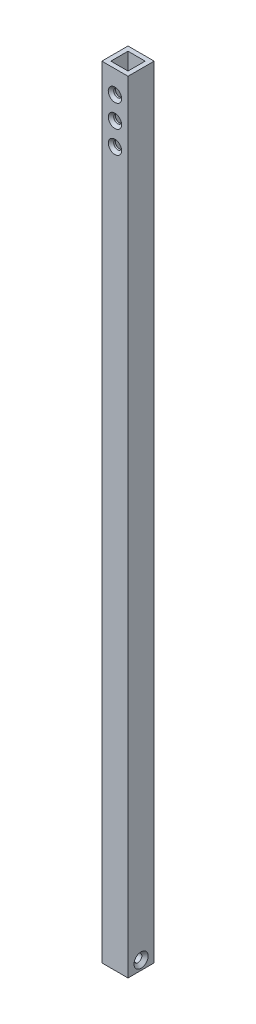
ISO-10303-21;
HEADER;
FILE_DESCRIPTION(('STEP AP214'),'2;1');
FILE_NAME('part.step','',(''),(''),'','','');
FILE_SCHEMA(('AUTOMOTIVE_DESIGN { 1 0 10303 214 1 1 1 1 }'));
ENDSEC;
DATA;
#1=APPLICATION_CONTEXT('core data for automotive mechanical design processes');
#2=APPLICATION_PROTOCOL_DEFINITION('international standard','automotive_design',2000,#1);
#3=PRODUCT_CONTEXT('',#1,'mechanical');
#4=PRODUCT('Part','Part','',(#3));
#5=PRODUCT_RELATED_PRODUCT_CATEGORY('part','',(#4));
#6=PRODUCT_DEFINITION_FORMATION('','',#4);
#7=PRODUCT_DEFINITION_CONTEXT('part definition',#1,'design');
#8=PRODUCT_DEFINITION('design','',#6,#7);
#9=PRODUCT_DEFINITION_SHAPE('','',#8);
#10=(LENGTH_UNIT() NAMED_UNIT(*) SI_UNIT(.MILLI.,.METRE.));
#11=(NAMED_UNIT(*) PLANE_ANGLE_UNIT() SI_UNIT($,.RADIAN.));
#12=(NAMED_UNIT(*) SI_UNIT($,.STERADIAN.) SOLID_ANGLE_UNIT());
#13=UNCERTAINTY_MEASURE_WITH_UNIT(LENGTH_MEASURE(1.E-05),#10,'distance_accuracy_value','');
#14=(GEOMETRIC_REPRESENTATION_CONTEXT(3) GLOBAL_UNCERTAINTY_ASSIGNED_CONTEXT((#13)) GLOBAL_UNIT_ASSIGNED_CONTEXT((#10,
#11,#12)) REPRESENTATION_CONTEXT('',''));
#15=CARTESIAN_POINT('',(0.,0.,0.));
#16=DIRECTION('',(0.,0.,1.));
#17=DIRECTION('',(1.,0.,0.));
#18=AXIS2_PLACEMENT_3D('',#15,#16,#17);
#19=CARTESIAN_POINT('',(-9.23,550.5,-9.23));
#20=DIRECTION('',(0.,-1.,0.));
#21=DIRECTION('',(0.,0.,-1.));
#22=AXIS2_PLACEMENT_3D('',#19,#20,#21);
#23=PLANE('',#22);
#24=DIRECTION('',(0.,0.,1.));
#25=VECTOR('',#24,1.);
#26=CARTESIAN_POINT('',(-9.23,550.5,9.23));
#27=LINE('',#26,#25);
#28=CARTESIAN_POINT('',(-9.23,550.5,-9.23));
#29=VERTEX_POINT('',#28);
#30=CARTESIAN_POINT('',(-9.23,550.5,9.23));
#31=VERTEX_POINT('',#30);
#32=EDGE_CURVE('E134',#29,#31,#27,.T.);
#33=ORIENTED_EDGE('',*,*,#32,.T.);
#34=DIRECTION('',(1.,0.,0.));
#35=VECTOR('',#34,1.);
#36=CARTESIAN_POINT('',(-9.23,550.5,9.23));
#37=LINE('',#36,#35);
#38=CARTESIAN_POINT('',(9.23,550.5,9.23));
#39=VERTEX_POINT('',#38);
#40=EDGE_CURVE('E137',#31,#39,#37,.T.);
#41=ORIENTED_EDGE('',*,*,#40,.T.);
#42=DIRECTION('',(0.,0.,-1.));
#43=VECTOR('',#42,1.);
#44=CARTESIAN_POINT('',(9.23,550.5,9.23));
#45=LINE('',#44,#43);
#46=CARTESIAN_POINT('',(9.23,550.5,-9.23));
#47=VERTEX_POINT('',#46);
#48=EDGE_CURVE('E140',#39,#47,#45,.T.);
#49=ORIENTED_EDGE('',*,*,#48,.T.);
#50=DIRECTION('',(-1.,0.,0.));
#51=VECTOR('',#50,1.);
#52=CARTESIAN_POINT('',(-9.23,550.5,-9.23));
#53=LINE('',#52,#51);
#54=EDGE_CURVE('E142',#47,#29,#53,.T.);
#55=ORIENTED_EDGE('',*,*,#54,.T.);
#56=EDGE_LOOP('',(#33,#41,#49,#55));
#57=FACE_BOUND('',#56,.T.);
#58=DIRECTION('',(0.,0.,1.));
#59=VECTOR('',#58,1.);
#60=CARTESIAN_POINT('',(-6.055,550.5,6.055));
#61=LINE('',#60,#59);
#62=CARTESIAN_POINT('',(-6.055,550.5,-6.055));
#63=VERTEX_POINT('',#62);
#64=CARTESIAN_POINT('',(-6.055,550.5,6.055));
#65=VERTEX_POINT('',#64);
#66=EDGE_CURVE('E118',#63,#65,#61,.T.);
#67=ORIENTED_EDGE('',*,*,#66,.F.);
#68=DIRECTION('',(-1.,0.,0.));
#69=VECTOR('',#68,1.);
#70=CARTESIAN_POINT('',(-6.055,550.5,-6.055));
#71=LINE('',#70,#69);
#72=CARTESIAN_POINT('',(6.055,550.5,-6.055));
#73=VERTEX_POINT('',#72);
#74=EDGE_CURVE('E106',#73,#63,#71,.T.);
#75=ORIENTED_EDGE('',*,*,#74,.F.);
#76=DIRECTION('',(0.,0.,-1.));
#77=VECTOR('',#76,1.);
#78=CARTESIAN_POINT('',(6.055,550.5,6.055));
#79=LINE('',#78,#77);
#80=CARTESIAN_POINT('',(6.055,550.5,6.055));
#81=VERTEX_POINT('',#80);
#82=EDGE_CURVE('E125',#81,#73,#79,.T.);
#83=ORIENTED_EDGE('',*,*,#82,.F.);
#84=DIRECTION('',(1.,0.,0.));
#85=VECTOR('',#84,1.);
#86=CARTESIAN_POINT('',(-6.055,550.5,6.055));
#87=LINE('',#86,#85);
#88=EDGE_CURVE('E120',#65,#81,#87,.T.);
#89=ORIENTED_EDGE('',*,*,#88,.F.);
#90=EDGE_LOOP('',(#67,#75,#83,#89));
#91=FACE_BOUND('',#90,.T.);
#92=ADVANCED_FACE('F31',(#57,#91),#23,.F.);
#93=CARTESIAN_POINT('',(-9.23,0.,-9.23));
#94=DIRECTION('',(0.,-1.,0.));
#95=DIRECTION('',(0.,0.,-1.));
#96=AXIS2_PLACEMENT_3D('',#93,#94,#95);
#97=PLANE('',#96);
#98=DIRECTION('',(0.,0.,1.));
#99=VECTOR('',#98,1.);
#100=CARTESIAN_POINT('',(-9.23,0.,9.23));
#101=LINE('',#100,#99);
#102=CARTESIAN_POINT('',(-9.23,0.,-9.23));
#103=VERTEX_POINT('',#102);
#104=CARTESIAN_POINT('',(-9.23,0.,9.23));
#105=VERTEX_POINT('',#104);
#106=EDGE_CURVE('E133',#103,#105,#101,.T.);
#107=ORIENTED_EDGE('',*,*,#106,.F.);
#108=DIRECTION('',(-1.,0.,0.));
#109=VECTOR('',#108,1.);
#110=CARTESIAN_POINT('',(-9.23,0.,-9.23));
#111=LINE('',#110,#109);
#112=CARTESIAN_POINT('',(9.23,0.,-9.23));
#113=VERTEX_POINT('',#112);
#114=EDGE_CURVE('E138',#113,#103,#111,.T.);
#115=ORIENTED_EDGE('',*,*,#114,.F.);
#116=DIRECTION('',(0.,0.,-1.));
#117=VECTOR('',#116,1.);
#118=CARTESIAN_POINT('',(9.23,0.,9.23));
#119=LINE('',#118,#117);
#120=CARTESIAN_POINT('',(9.23,0.,9.23));
#121=VERTEX_POINT('',#120);
#122=EDGE_CURVE('E149',#121,#113,#119,.T.);
#123=ORIENTED_EDGE('',*,*,#122,.F.);
#124=DIRECTION('',(1.,0.,0.));
#125=VECTOR('',#124,1.);
#126=CARTESIAN_POINT('',(-9.23,0.,9.23));
#127=LINE('',#126,#125);
#128=EDGE_CURVE('E147',#105,#121,#127,.T.);
#129=ORIENTED_EDGE('',*,*,#128,.F.);
#130=EDGE_LOOP('',(#107,#115,#123,#129));
#131=FACE_BOUND('',#130,.T.);
#132=ADVANCED_FACE('F207',(#131),#97,.T.);
#133=CARTESIAN_POINT('',(-9.23,550.5,9.23));
#134=DIRECTION('',(1.,0.,0.));
#135=DIRECTION('',(0.,0.,-1.));
#136=AXIS2_PLACEMENT_3D('',#133,#134,#135);
#137=PLANE('',#136);
#138=CARTESIAN_POINT('',(-9.23,6.365,0.));
#139=DIRECTION('',(-1.,0.,0.));
#140=DIRECTION('',(0.,0.,1.));
#141=AXIS2_PLACEMENT_3D('',#138,#139,#140);
#142=CIRCLE('',#141,2.775);
#143=CARTESIAN_POINT('',(-9.23,6.365,2.775));
#144=VERTEX_POINT('',#143);
#145=EDGE_CURVE('E197',#144,#144,#142,.T.);
#146=ORIENTED_EDGE('',*,*,#145,.F.);
#147=EDGE_LOOP('',(#146));
#148=FACE_BOUND('',#147,.T.);
#149=ORIENTED_EDGE('',*,*,#106,.T.);
#150=DIRECTION('',(0.,-1.,0.));
#151=VECTOR('',#150,1.);
#152=CARTESIAN_POINT('',(-9.23,550.5,9.23));
#153=LINE('',#152,#151);
#154=EDGE_CURVE('E11',#31,#105,#153,.T.);
#155=ORIENTED_EDGE('',*,*,#154,.F.);
#156=ORIENTED_EDGE('',*,*,#32,.F.);
#157=DIRECTION('',(0.,-1.,0.));
#158=VECTOR('',#157,1.);
#159=CARTESIAN_POINT('',(-9.23,550.5,-9.23));
#160=LINE('',#159,#158);
#161=EDGE_CURVE('E144',#29,#103,#160,.T.);
#162=ORIENTED_EDGE('',*,*,#161,.T.);
#163=EDGE_LOOP('',(#149,#155,#156,#162));
#164=FACE_BOUND('',#163,.T.);
#165=ADVANCED_FACE('F33',(#148,#164),#137,.F.);
#166=CARTESIAN_POINT('',(-9.23,550.5,9.23));
#167=DIRECTION('',(0.,0.,-1.));
#168=DIRECTION('',(-1.,0.,0.));
#169=AXIS2_PLACEMENT_3D('',#166,#167,#168);
#170=PLANE('',#169);
#171=CARTESIAN_POINT('',(0.,502.775,9.23));
#172=DIRECTION('',(0.,0.,-1.));
#173=DIRECTION('',(-1.,0.,0.));
#174=AXIS2_PLACEMENT_3D('',#171,#172,#173);
#175=CIRCLE('',#174,4.70000000000004);
#176=CARTESIAN_POINT('',(-4.70000000000004,502.775,9.23));
#177=VERTEX_POINT('',#176);
#178=EDGE_CURVE('E296',#177,#177,#175,.T.);
#179=ORIENTED_EDGE('',*,*,#178,.T.);
#180=EDGE_LOOP('',(#179));
#181=FACE_BOUND('',#180,.T.);
#182=CARTESIAN_POINT('',(0.,518.675,9.23));
#183=DIRECTION('',(0.,0.,-1.));
#184=DIRECTION('',(-1.,0.,0.));
#185=AXIS2_PLACEMENT_3D('',#182,#183,#184);
#186=CIRCLE('',#185,4.70000000000004);
#187=CARTESIAN_POINT('',(-4.70000000000004,518.675,9.23));
#188=VERTEX_POINT('',#187);
#189=EDGE_CURVE('E178',#188,#188,#186,.T.);
#190=ORIENTED_EDGE('',*,*,#189,.T.);
#191=EDGE_LOOP('',(#190));
#192=FACE_BOUND('',#191,.T.);
#193=CARTESIAN_POINT('',(0.,534.575,9.23));
#194=DIRECTION('',(0.,0.,-1.));
#195=DIRECTION('',(-1.,0.,0.));
#196=AXIS2_PLACEMENT_3D('',#193,#194,#195);
#197=CIRCLE('',#196,4.70000000000004);
#198=CARTESIAN_POINT('',(-4.70000000000004,534.575,9.23));
#199=VERTEX_POINT('',#198);
#200=EDGE_CURVE('E170',#199,#199,#197,.T.);
#201=ORIENTED_EDGE('',*,*,#200,.T.);
#202=EDGE_LOOP('',(#201));
#203=FACE_BOUND('',#202,.T.);
#204=ORIENTED_EDGE('',*,*,#128,.T.);
#205=DIRECTION('',(0.,-1.,0.));
#206=VECTOR('',#205,1.);
#207=CARTESIAN_POINT('',(9.23,550.5,9.23));
#208=LINE('',#207,#206);
#209=EDGE_CURVE('E40',#39,#121,#208,.T.);
#210=ORIENTED_EDGE('',*,*,#209,.F.);
#211=ORIENTED_EDGE('',*,*,#40,.F.);
#212=ORIENTED_EDGE('',*,*,#154,.T.);
#213=EDGE_LOOP('',(#204,#210,#211,#212));
#214=FACE_BOUND('',#213,.T.);
#215=ADVANCED_FACE('F206',(#181,#192,#203,#214),#170,.F.);
#216=CARTESIAN_POINT('',(9.23,550.5,9.23));
#217=DIRECTION('',(-1.,0.,0.));
#218=DIRECTION('',(0.,0.,1.));
#219=AXIS2_PLACEMENT_3D('',#216,#217,#218);
#220=PLANE('',#219);
#221=CARTESIAN_POINT('',(9.23,6.365,0.));
#222=DIRECTION('',(-1.,0.,0.));
#223=DIRECTION('',(0.,0.,1.));
#224=AXIS2_PLACEMENT_3D('',#221,#222,#223);
#225=CIRCLE('',#224,5.);
#226=CARTESIAN_POINT('',(9.23,6.365,5.));
#227=VERTEX_POINT('',#226);
#228=EDGE_CURVE('E191',#227,#227,#225,.T.);
#229=ORIENTED_EDGE('',*,*,#228,.T.);
#230=EDGE_LOOP('',(#229));
#231=FACE_BOUND('',#230,.T.);
#232=ORIENTED_EDGE('',*,*,#122,.T.);
#233=DIRECTION('',(0.,-1.,0.));
#234=VECTOR('',#233,1.);
#235=CARTESIAN_POINT('',(9.23,550.5,-9.23));
#236=LINE('',#235,#234);
#237=EDGE_CURVE('E154',#47,#113,#236,.T.);
#238=ORIENTED_EDGE('',*,*,#237,.F.);
#239=ORIENTED_EDGE('',*,*,#48,.F.);
#240=ORIENTED_EDGE('',*,*,#209,.T.);
#241=EDGE_LOOP('',(#232,#238,#239,#240));
#242=FACE_BOUND('',#241,.T.);
#243=ADVANCED_FACE('F225',(#231,#242),#220,.F.);
#244=CARTESIAN_POINT('',(-9.23,550.5,-9.23));
#245=DIRECTION('',(0.,0.,1.));
#246=DIRECTION('',(1.,0.,0.));
#247=AXIS2_PLACEMENT_3D('',#244,#245,#246);
#248=PLANE('',#247);
#249=CARTESIAN_POINT('',(0.,502.775,-9.23));
#250=DIRECTION('',(0.,0.,-1.));
#251=DIRECTION('',(-1.,0.,0.));
#252=AXIS2_PLACEMENT_3D('',#249,#250,#251);
#253=CIRCLE('',#252,2.77499999999997);
#254=CARTESIAN_POINT('',(-2.77499999999997,502.775,-9.23));
#255=VERTEX_POINT('',#254);
#256=EDGE_CURVE('E301',#255,#255,#253,.T.);
#257=ORIENTED_EDGE('',*,*,#256,.F.);
#258=EDGE_LOOP('',(#257));
#259=FACE_BOUND('',#258,.T.);
#260=CARTESIAN_POINT('',(0.,518.675,-9.23));
#261=DIRECTION('',(0.,0.,-1.));
#262=DIRECTION('',(-1.,0.,0.));
#263=AXIS2_PLACEMENT_3D('',#260,#261,#262);
#264=CIRCLE('',#263,2.77499999999997);
#265=CARTESIAN_POINT('',(-2.77499999999997,518.675,-9.23));
#266=VERTEX_POINT('',#265);
#267=EDGE_CURVE('E166',#266,#266,#264,.T.);
#268=ORIENTED_EDGE('',*,*,#267,.F.);
#269=EDGE_LOOP('',(#268));
#270=FACE_BOUND('',#269,.T.);
#271=CARTESIAN_POINT('',(0.,534.575,-9.23));
#272=DIRECTION('',(0.,0.,-1.));
#273=DIRECTION('',(-1.,0.,0.));
#274=AXIS2_PLACEMENT_3D('',#271,#272,#273);
#275=CIRCLE('',#274,2.77499999999997);
#276=CARTESIAN_POINT('',(-2.77499999999997,534.575,-9.23));
#277=VERTEX_POINT('',#276);
#278=EDGE_CURVE('E162',#277,#277,#275,.T.);
#279=ORIENTED_EDGE('',*,*,#278,.F.);
#280=EDGE_LOOP('',(#279));
#281=FACE_BOUND('',#280,.T.);
#282=ORIENTED_EDGE('',*,*,#114,.T.);
#283=ORIENTED_EDGE('',*,*,#161,.F.);
#284=ORIENTED_EDGE('',*,*,#54,.F.);
#285=ORIENTED_EDGE('',*,*,#237,.T.);
#286=EDGE_LOOP('',(#282,#283,#284,#285));
#287=FACE_BOUND('',#286,.T.);
#288=ADVANCED_FACE('F223',(#259,#270,#281,#287),#248,.F.);
#289=CARTESIAN_POINT('',(-6.055,550.5,6.055));
#290=DIRECTION('',(1.,0.,0.));
#291=DIRECTION('',(0.,0.,-1.));
#292=AXIS2_PLACEMENT_3D('',#289,#290,#291);
#293=PLANE('',#292);
#294=DIRECTION('',(0.,0.,-1.));
#295=VECTOR('',#294,1.);
#296=CARTESIAN_POINT('',(-6.055,12.7,6.055));
#297=LINE('',#296,#295);
#298=CARTESIAN_POINT('',(-6.055,12.7,6.055));
#299=VERTEX_POINT('',#298);
#300=CARTESIAN_POINT('',(-6.055,12.7,-6.055));
#301=VERTEX_POINT('',#300);
#302=EDGE_CURVE('E112',#299,#301,#297,.T.);
#303=ORIENTED_EDGE('',*,*,#302,.T.);
#304=DIRECTION('',(0.,-1.,0.));
#305=VECTOR('',#304,1.);
#306=CARTESIAN_POINT('',(-6.055,550.5,-6.055));
#307=LINE('',#306,#305);
#308=EDGE_CURVE('E100',#63,#301,#307,.T.);
#309=ORIENTED_EDGE('',*,*,#308,.F.);
#310=ORIENTED_EDGE('',*,*,#66,.T.);
#311=DIRECTION('',(0.,-1.,0.));
#312=VECTOR('',#311,1.);
#313=CARTESIAN_POINT('',(-6.055,550.5,6.055));
#314=LINE('',#313,#312);
#315=EDGE_CURVE('E114',#65,#299,#314,.T.);
#316=ORIENTED_EDGE('',*,*,#315,.T.);
#317=EDGE_LOOP('',(#303,#309,#310,#316));
#318=FACE_BOUND('',#317,.T.);
#319=ADVANCED_FACE('F113',(#318),#293,.T.);
#320=CARTESIAN_POINT('',(-6.055,550.5,6.055));
#321=DIRECTION('',(0.,0.,-1.));
#322=DIRECTION('',(-1.,0.,0.));
#323=AXIS2_PLACEMENT_3D('',#320,#321,#322);
#324=PLANE('',#323);
#325=CARTESIAN_POINT('',(0.,502.775,6.055));
#326=DIRECTION('',(0.,0.,-1.));
#327=DIRECTION('',(-1.,0.,0.));
#328=AXIS2_PLACEMENT_3D('',#325,#326,#327);
#329=CIRCLE('',#328,2.77499999999997);
#330=CARTESIAN_POINT('',(-2.77499999999997,502.775,6.055));
#331=VERTEX_POINT('',#330);
#332=EDGE_CURVE('E307',#331,#331,#329,.T.);
#333=ORIENTED_EDGE('',*,*,#332,.F.);
#334=EDGE_LOOP('',(#333));
#335=FACE_BOUND('',#334,.T.);
#336=CARTESIAN_POINT('',(0.,518.675,6.055));
#337=DIRECTION('',(0.,0.,-1.));
#338=DIRECTION('',(-1.,0.,0.));
#339=AXIS2_PLACEMENT_3D('',#336,#337,#338);
#340=CIRCLE('',#339,2.77499999999997);
#341=CARTESIAN_POINT('',(-2.77499999999997,518.675,6.055));
#342=VERTEX_POINT('',#341);
#343=EDGE_CURVE('E165',#342,#342,#340,.T.);
#344=ORIENTED_EDGE('',*,*,#343,.F.);
#345=EDGE_LOOP('',(#344));
#346=FACE_BOUND('',#345,.T.);
#347=CARTESIAN_POINT('',(0.,534.575,6.055));
#348=DIRECTION('',(0.,0.,-1.));
#349=DIRECTION('',(-1.,0.,0.));
#350=AXIS2_PLACEMENT_3D('',#347,#348,#349);
#351=CIRCLE('',#350,2.77499999999997);
#352=CARTESIAN_POINT('',(-2.77499999999997,534.575,6.055));
#353=VERTEX_POINT('',#352);
#354=EDGE_CURVE('E161',#353,#353,#351,.T.);
#355=ORIENTED_EDGE('',*,*,#354,.F.);
#356=EDGE_LOOP('',(#355));
#357=FACE_BOUND('',#356,.T.);
#358=DIRECTION('',(-1.,0.,0.));
#359=VECTOR('',#358,1.);
#360=CARTESIAN_POINT('',(6.055,12.7,6.055));
#361=LINE('',#360,#359);
#362=CARTESIAN_POINT('',(6.055,12.7,6.055));
#363=VERTEX_POINT('',#362);
#364=EDGE_CURVE('E48',#363,#299,#361,.T.);
#365=ORIENTED_EDGE('',*,*,#364,.T.);
#366=ORIENTED_EDGE('',*,*,#315,.F.);
#367=ORIENTED_EDGE('',*,*,#88,.T.);
#368=DIRECTION('',(0.,-1.,0.));
#369=VECTOR('',#368,1.);
#370=CARTESIAN_POINT('',(6.055,550.5,6.055));
#371=LINE('',#370,#369);
#372=EDGE_CURVE('E130',#81,#363,#371,.T.);
#373=ORIENTED_EDGE('',*,*,#372,.T.);
#374=EDGE_LOOP('',(#365,#366,#367,#373));
#375=FACE_BOUND('',#374,.T.);
#376=ADVANCED_FACE('F245',(#335,#346,#357,#375),#324,.T.);
#377=CARTESIAN_POINT('',(6.055,550.5,6.055));
#378=DIRECTION('',(-1.,0.,0.));
#379=DIRECTION('',(0.,0.,1.));
#380=AXIS2_PLACEMENT_3D('',#377,#378,#379);
#381=PLANE('',#380);
#382=DIRECTION('',(0.,0.,1.));
#383=VECTOR('',#382,1.);
#384=CARTESIAN_POINT('',(6.055,12.7,6.055));
#385=LINE('',#384,#383);
#386=CARTESIAN_POINT('',(6.055,12.7,-6.055));
#387=VERTEX_POINT('',#386);
#388=EDGE_CURVE('E56',#387,#363,#385,.T.);
#389=ORIENTED_EDGE('',*,*,#388,.T.);
#390=ORIENTED_EDGE('',*,*,#372,.F.);
#391=ORIENTED_EDGE('',*,*,#82,.T.);
#392=DIRECTION('',(0.,-1.,0.));
#393=VECTOR('',#392,1.);
#394=CARTESIAN_POINT('',(6.055,550.5,-6.055));
#395=LINE('',#394,#393);
#396=EDGE_CURVE('E109',#73,#387,#395,.T.);
#397=ORIENTED_EDGE('',*,*,#396,.T.);
#398=EDGE_LOOP('',(#389,#390,#391,#397));
#399=FACE_BOUND('',#398,.T.);
#400=ADVANCED_FACE('F248',(#399),#381,.T.);
#401=CARTESIAN_POINT('',(-6.055,550.5,-6.055));
#402=DIRECTION('',(0.,0.,1.));
#403=DIRECTION('',(1.,0.,0.));
#404=AXIS2_PLACEMENT_3D('',#401,#402,#403);
#405=PLANE('',#404);
#406=CARTESIAN_POINT('',(0.,502.775,-6.055));
#407=DIRECTION('',(0.,0.,1.));
#408=DIRECTION('',(1.,0.,0.));
#409=AXIS2_PLACEMENT_3D('',#406,#407,#408);
#410=CIRCLE('',#409,2.77499999999997);
#411=CARTESIAN_POINT('',(2.77499999999997,502.775,-6.055));
#412=VERTEX_POINT('',#411);
#413=EDGE_CURVE('E35',#412,#412,#410,.T.);
#414=ORIENTED_EDGE('',*,*,#413,.F.);
#415=EDGE_LOOP('',(#414));
#416=FACE_BOUND('',#415,.T.);
#417=CARTESIAN_POINT('',(0.,518.675,-6.055));
#418=DIRECTION('',(0.,0.,1.));
#419=DIRECTION('',(1.,0.,0.));
#420=AXIS2_PLACEMENT_3D('',#417,#418,#419);
#421=CIRCLE('',#420,2.77499999999997);
#422=CARTESIAN_POINT('',(2.77499999999997,518.675,-6.055));
#423=VERTEX_POINT('',#422);
#424=EDGE_CURVE('E163',#423,#423,#421,.T.);
#425=ORIENTED_EDGE('',*,*,#424,.F.);
#426=EDGE_LOOP('',(#425));
#427=FACE_BOUND('',#426,.T.);
#428=CARTESIAN_POINT('',(0.,534.575,-6.055));
#429=DIRECTION('',(0.,0.,1.));
#430=DIRECTION('',(1.,0.,0.));
#431=AXIS2_PLACEMENT_3D('',#428,#429,#430);
#432=CIRCLE('',#431,2.77499999999997);
#433=CARTESIAN_POINT('',(2.77499999999997,534.575,-6.055));
#434=VERTEX_POINT('',#433);
#435=EDGE_CURVE('E159',#434,#434,#432,.T.);
#436=ORIENTED_EDGE('',*,*,#435,.F.);
#437=EDGE_LOOP('',(#436));
#438=FACE_BOUND('',#437,.T.);
#439=DIRECTION('',(1.,0.,0.));
#440=VECTOR('',#439,1.);
#441=CARTESIAN_POINT('',(6.055,12.7,-6.055));
#442=LINE('',#441,#440);
#443=EDGE_CURVE('E104',#301,#387,#442,.T.);
#444=ORIENTED_EDGE('',*,*,#443,.T.);
#445=ORIENTED_EDGE('',*,*,#396,.F.);
#446=ORIENTED_EDGE('',*,*,#74,.T.);
#447=ORIENTED_EDGE('',*,*,#308,.T.);
#448=EDGE_LOOP('',(#444,#445,#446,#447));
#449=FACE_BOUND('',#448,.T.);
#450=ADVANCED_FACE('F102',(#416,#427,#438,#449),#405,.T.);
#451=CARTESIAN_POINT('',(6.055,12.7,-6.055));
#452=DIRECTION('',(0.,1.,0.));
#453=DIRECTION('',(0.,0.,1.));
#454=AXIS2_PLACEMENT_3D('',#451,#452,#453);
#455=PLANE('',#454);
#456=ORIENTED_EDGE('',*,*,#388,.F.);
#457=ORIENTED_EDGE('',*,*,#443,.F.);
#458=ORIENTED_EDGE('',*,*,#302,.F.);
#459=ORIENTED_EDGE('',*,*,#364,.F.);
#460=EDGE_LOOP('',(#456,#457,#458,#459));
#461=FACE_BOUND('',#460,.T.);
#462=ADVANCED_FACE('F117',(#461),#455,.T.);
#463=CARTESIAN_POINT('',(-9.23,6.365,0.));
#464=DIRECTION('',(-1.,0.,0.));
#465=DIRECTION('',(0.,0.,1.));
#466=AXIS2_PLACEMENT_3D('',#463,#464,#465);
#467=CYLINDRICAL_SURFACE('',#466,2.775);
#468=CARTESIAN_POINT('',(7.00500000000001,6.365,0.));
#469=DIRECTION('',(-1.,0.,0.));
#470=DIRECTION('',(0.,0.,1.));
#471=AXIS2_PLACEMENT_3D('',#468,#469,#470);
#472=CIRCLE('',#471,2.775);
#473=CARTESIAN_POINT('',(7.00500000000001,6.365,2.775));
#474=VERTEX_POINT('',#473);
#475=EDGE_CURVE('E194',#474,#474,#472,.T.);
#476=ORIENTED_EDGE('',*,*,#475,.F.);
#477=EDGE_LOOP('',(#476));
#478=FACE_BOUND('',#477,.T.);
#479=ORIENTED_EDGE('',*,*,#145,.T.);
#480=EDGE_LOOP('',(#479));
#481=FACE_BOUND('',#480,.T.);
#482=ADVANCED_FACE('F202',(#478,#481),#467,.F.);
#483=CARTESIAN_POINT('',(7.00500000000001,6.365,0.));
#484=DIRECTION('',(1.,0.,0.));
#485=DIRECTION('',(0.,0.,-1.));
#486=AXIS2_PLACEMENT_3D('',#483,#484,#485);
#487=CONICAL_SURFACE('',#486,2.775,0.78539816339745);
#488=ORIENTED_EDGE('',*,*,#228,.F.);
#489=EDGE_LOOP('',(#488));
#490=FACE_BOUND('',#489,.T.);
#491=ORIENTED_EDGE('',*,*,#475,.T.);
#492=EDGE_LOOP('',(#491));
#493=FACE_BOUND('',#492,.T.);
#494=ADVANCED_FACE('F259',(#490,#493),#487,.F.);
#495=CARTESIAN_POINT('',(0.,534.575,9.23));
#496=DIRECTION('',(0.,0.,-1.));
#497=DIRECTION('',(-1.,0.,0.));
#498=AXIS2_PLACEMENT_3D('',#495,#496,#497);
#499=CYLINDRICAL_SURFACE('',#498,2.77499999999997);
#500=ORIENTED_EDGE('',*,*,#435,.T.);
#501=EDGE_LOOP('',(#500));
#502=FACE_BOUND('',#501,.T.);
#503=ORIENTED_EDGE('',*,*,#278,.T.);
#504=EDGE_LOOP('',(#503));
#505=FACE_BOUND('',#504,.T.);
#506=ADVANCED_FACE('F263',(#502,#505),#499,.F.);
#507=ORIENTED_EDGE('',*,*,#354,.T.);
#508=EDGE_LOOP('',(#507));
#509=FACE_BOUND('',#508,.T.);
#510=CARTESIAN_POINT('',(0.,534.575,7.30499999999996));
#511=DIRECTION('',(0.,0.,-1.));
#512=DIRECTION('',(-1.,0.,0.));
#513=AXIS2_PLACEMENT_3D('',#510,#511,#512);
#514=CIRCLE('',#513,2.77499999999997);
#515=CARTESIAN_POINT('',(-2.77499999999997,534.575,7.30499999999996));
#516=VERTEX_POINT('',#515);
#517=EDGE_CURVE('E184',#516,#516,#514,.T.);
#518=ORIENTED_EDGE('',*,*,#517,.F.);
#519=EDGE_LOOP('',(#518));
#520=FACE_BOUND('',#519,.T.);
#521=ADVANCED_FACE('F267',(#509,#520),#499,.F.);
#522=CARTESIAN_POINT('',(0.,534.575,7.30499999999996));
#523=DIRECTION('',(0.,0.,1.));
#524=DIRECTION('',(1.,0.,0.));
#525=AXIS2_PLACEMENT_3D('',#522,#523,#524);
#526=CONICAL_SURFACE('',#525,2.77499999999997,0.785398163397455);
#527=ORIENTED_EDGE('',*,*,#200,.F.);
#528=EDGE_LOOP('',(#527));
#529=FACE_BOUND('',#528,.T.);
#530=ORIENTED_EDGE('',*,*,#517,.T.);
#531=EDGE_LOOP('',(#530));
#532=FACE_BOUND('',#531,.T.);
#533=ADVANCED_FACE('F269',(#529,#532),#526,.F.);
#534=CARTESIAN_POINT('',(0.,518.675,9.23));
#535=DIRECTION('',(0.,0.,-1.));
#536=DIRECTION('',(-1.,0.,0.));
#537=AXIS2_PLACEMENT_3D('',#534,#535,#536);
#538=CYLINDRICAL_SURFACE('',#537,2.77499999999997);
#539=ORIENTED_EDGE('',*,*,#424,.T.);
#540=EDGE_LOOP('',(#539));
#541=FACE_BOUND('',#540,.T.);
#542=ORIENTED_EDGE('',*,*,#267,.T.);
#543=EDGE_LOOP('',(#542));
#544=FACE_BOUND('',#543,.T.);
#545=ADVANCED_FACE('F272',(#541,#544),#538,.F.);
#546=ORIENTED_EDGE('',*,*,#343,.T.);
#547=EDGE_LOOP('',(#546));
#548=FACE_BOUND('',#547,.T.);
#549=CARTESIAN_POINT('',(0.,518.675,7.30499999999996));
#550=DIRECTION('',(0.,0.,-1.));
#551=DIRECTION('',(-1.,0.,0.));
#552=AXIS2_PLACEMENT_3D('',#549,#550,#551);
#553=CIRCLE('',#552,2.77499999999997);
#554=CARTESIAN_POINT('',(-2.77499999999997,518.675,7.30499999999996));
#555=VERTEX_POINT('',#554);
#556=EDGE_CURVE('E173',#555,#555,#553,.T.);
#557=ORIENTED_EDGE('',*,*,#556,.F.);
#558=EDGE_LOOP('',(#557));
#559=FACE_BOUND('',#558,.T.);
#560=ADVANCED_FACE('F276',(#548,#559),#538,.F.);
#561=CARTESIAN_POINT('',(0.,518.675,7.30499999999996));
#562=DIRECTION('',(0.,0.,1.));
#563=DIRECTION('',(1.,0.,0.));
#564=AXIS2_PLACEMENT_3D('',#561,#562,#563);
#565=CONICAL_SURFACE('',#564,2.77499999999997,0.785398163397455);
#566=ORIENTED_EDGE('',*,*,#189,.F.);
#567=EDGE_LOOP('',(#566));
#568=FACE_BOUND('',#567,.T.);
#569=ORIENTED_EDGE('',*,*,#556,.T.);
#570=EDGE_LOOP('',(#569));
#571=FACE_BOUND('',#570,.T.);
#572=ADVANCED_FACE('F277',(#568,#571),#565,.F.);
#573=CARTESIAN_POINT('',(0.,502.775,9.23));
#574=DIRECTION('',(0.,0.,-1.));
#575=DIRECTION('',(-1.,0.,0.));
#576=AXIS2_PLACEMENT_3D('',#573,#574,#575);
#577=CYLINDRICAL_SURFACE('',#576,2.77499999999997);
#578=ORIENTED_EDGE('',*,*,#413,.T.);
#579=EDGE_LOOP('',(#578));
#580=FACE_BOUND('',#579,.T.);
#581=ORIENTED_EDGE('',*,*,#256,.T.);
#582=EDGE_LOOP('',(#581));
#583=FACE_BOUND('',#582,.T.);
#584=ADVANCED_FACE('F280',(#580,#583),#577,.F.);
#585=ORIENTED_EDGE('',*,*,#332,.T.);
#586=EDGE_LOOP('',(#585));
#587=FACE_BOUND('',#586,.T.);
#588=CARTESIAN_POINT('',(0.,502.775,7.30499999999996));
#589=DIRECTION('',(0.,0.,-1.));
#590=DIRECTION('',(-1.,0.,0.));
#591=AXIS2_PLACEMENT_3D('',#588,#589,#590);
#592=CIRCLE('',#591,2.77499999999997);
#593=CARTESIAN_POINT('',(-2.77499999999997,502.775,7.30499999999996));
#594=VERTEX_POINT('',#593);
#595=EDGE_CURVE('E299',#594,#594,#592,.T.);
#596=ORIENTED_EDGE('',*,*,#595,.F.);
#597=EDGE_LOOP('',(#596));
#598=FACE_BOUND('',#597,.T.);
#599=ADVANCED_FACE('F284',(#587,#598),#577,.F.);
#600=CARTESIAN_POINT('',(0.,502.775,7.30499999999996));
#601=DIRECTION('',(0.,0.,1.));
#602=DIRECTION('',(1.,0.,0.));
#603=AXIS2_PLACEMENT_3D('',#600,#601,#602);
#604=CONICAL_SURFACE('',#603,2.77499999999997,0.785398163397455);
#605=ORIENTED_EDGE('',*,*,#178,.F.);
#606=EDGE_LOOP('',(#605));
#607=FACE_BOUND('',#606,.T.);
#608=ORIENTED_EDGE('',*,*,#595,.T.);
#609=EDGE_LOOP('',(#608));
#610=FACE_BOUND('',#609,.T.);
#611=ADVANCED_FACE('F286',(#607,#610),#604,.F.);
#612=CLOSED_SHELL('',(#92,#132,#165,#215,#243,#288,#319,#376,#400,#450,#462,#482,#494,#506,#521,
#533,#545,#560,#572,#584,#599,#611));
#613=MANIFOLD_SOLID_BREP('B2',#612);
#614=ADVANCED_BREP_SHAPE_REPRESENTATION('',(#18,#613),#14);
#615=SHAPE_DEFINITION_REPRESENTATION(#9,#614);
ENDSEC;
END-ISO-10303-21;
